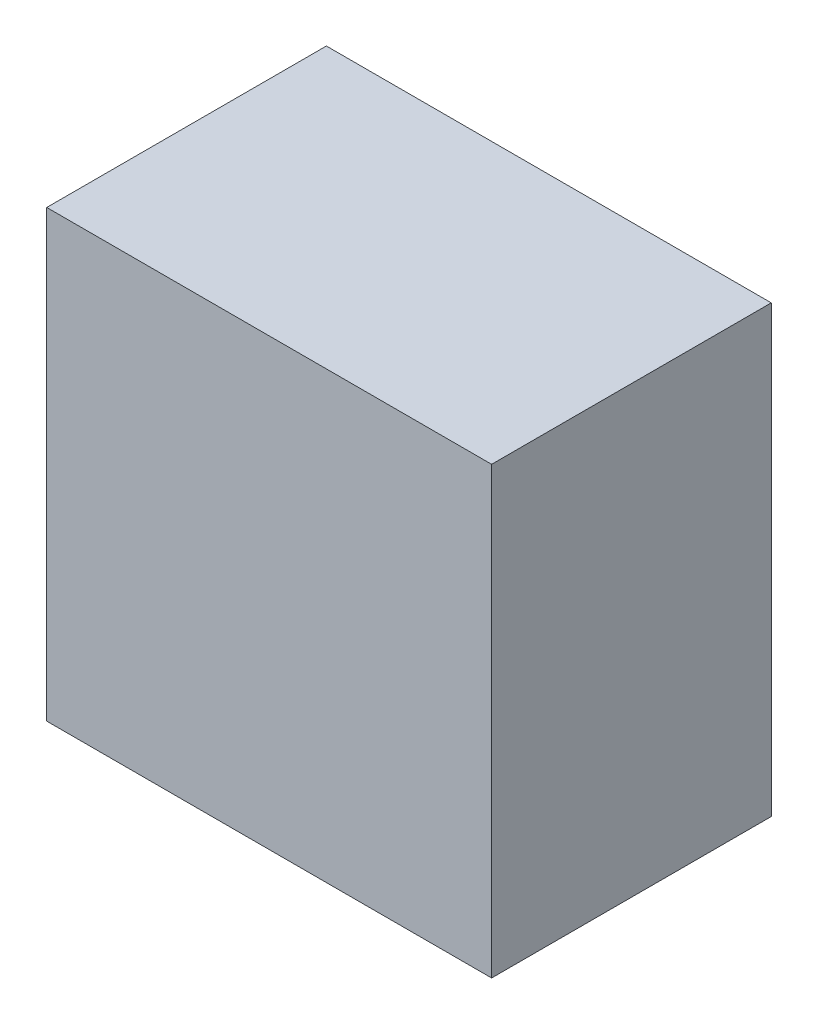
ISO-10303-21;
HEADER;
FILE_DESCRIPTION(('STEP AP214'),'2;1');
FILE_NAME('part.step','',(''),(''),'','','');
FILE_SCHEMA(('AUTOMOTIVE_DESIGN { 1 0 10303 214 1 1 1 1 }'));
ENDSEC;
DATA;
#1=APPLICATION_CONTEXT('core data for automotive mechanical design processes');
#2=APPLICATION_PROTOCOL_DEFINITION('international standard','automotive_design',2000,#1);
#3=PRODUCT_CONTEXT('',#1,'mechanical');
#4=PRODUCT('Part','Part','',(#3));
#5=PRODUCT_RELATED_PRODUCT_CATEGORY('part','',(#4));
#6=PRODUCT_DEFINITION_FORMATION('','',#4);
#7=PRODUCT_DEFINITION_CONTEXT('part definition',#1,'design');
#8=PRODUCT_DEFINITION('design','',#6,#7);
#9=PRODUCT_DEFINITION_SHAPE('','',#8);
#10=(LENGTH_UNIT() NAMED_UNIT(*) SI_UNIT(.MILLI.,.METRE.));
#11=(NAMED_UNIT(*) PLANE_ANGLE_UNIT() SI_UNIT($,.RADIAN.));
#12=(NAMED_UNIT(*) SI_UNIT($,.STERADIAN.) SOLID_ANGLE_UNIT());
#13=UNCERTAINTY_MEASURE_WITH_UNIT(LENGTH_MEASURE(1.E-05),#10,'distance_accuracy_value','');
#14=(GEOMETRIC_REPRESENTATION_CONTEXT(3) GLOBAL_UNCERTAINTY_ASSIGNED_CONTEXT((#13)) GLOBAL_UNIT_ASSIGNED_CONTEXT((#10,
#11,#12)) REPRESENTATION_CONTEXT('',''));
#15=CARTESIAN_POINT('',(0.,0.,0.));
#16=DIRECTION('',(0.,0.,1.));
#17=DIRECTION('',(1.,0.,0.));
#18=AXIS2_PLACEMENT_3D('',#15,#16,#17);
#19=CARTESIAN_POINT('',(-0.35000184,-0.3499993,0.43999912));
#20=DIRECTION('',(0.,0.,1.));
#21=DIRECTION('',(1.,0.,0.));
#22=AXIS2_PLACEMENT_3D('',#19,#20,#21);
#23=PLANE('',#22);
#24=DIRECTION('',(-0.999999999993417,-3.62855234844451E-06,0.));
#25=VECTOR('',#24,1.);
#26=CARTESIAN_POINT('',(-0.35000184,0.3499993,0.43999912));
#27=LINE('',#26,#25);
#28=CARTESIAN_POINT('',(-0.35000184,0.35000057,0.43999912));
#29=VERTEX_POINT('',#28);
#30=CARTESIAN_POINT('',(0.35000184,0.350001839999999,0.43999912));
#31=VERTEX_POINT('',#30);
#32=EDGE_CURVE('E53',#29,#31,#27,.F.);
#33=ORIENTED_EDGE('',*,*,#32,.F.);
#34=DIRECTION('',(0.,1.,0.));
#35=VECTOR('',#34,1.);
#36=CARTESIAN_POINT('',(-0.35000184,-0.3499993,0.43999912));
#37=LINE('',#36,#35);
#38=CARTESIAN_POINT('',(-0.35000184,-0.3499993,0.43999912));
#39=VERTEX_POINT('',#38);
#40=EDGE_CURVE('E68',#39,#29,#37,.T.);
#41=ORIENTED_EDGE('',*,*,#40,.F.);
#42=DIRECTION('',(1.,0.,0.));
#43=VECTOR('',#42,1.);
#44=CARTESIAN_POINT('',(0.35000184,-0.3499993,0.43999912));
#45=LINE('',#44,#43);
#46=CARTESIAN_POINT('',(0.35000184,-0.3499993,0.43999912));
#47=VERTEX_POINT('',#46);
#48=EDGE_CURVE('E20',#47,#39,#45,.F.);
#49=ORIENTED_EDGE('',*,*,#48,.F.);
#50=DIRECTION('',(0.,1.,0.));
#51=VECTOR('',#50,1.);
#52=CARTESIAN_POINT('',(0.35000184,0.35000184,0.43999912));
#53=LINE('',#52,#51);
#54=EDGE_CURVE('E58',#31,#47,#53,.F.);
#55=ORIENTED_EDGE('',*,*,#54,.F.);
#56=EDGE_LOOP('',(#33,#41,#49,#55));
#57=FACE_BOUND('',#56,.T.);
#58=ADVANCED_FACE('F17',(#57),#23,.T.);
#59=CARTESIAN_POINT('',(0.35000184,-0.3499993,0.));
#60=DIRECTION('',(0.,-1.,0.));
#61=DIRECTION('',(0.,0.,-1.));
#62=AXIS2_PLACEMENT_3D('',#59,#60,#61);
#63=PLANE('',#62);
#64=DIRECTION('',(0.,0.,1.));
#65=VECTOR('',#64,1.);
#66=CARTESIAN_POINT('',(-0.35000184,-0.3499993,0.));
#67=LINE('',#66,#65);
#68=CARTESIAN_POINT('',(-0.35000184,-0.3499993,0.));
#69=VERTEX_POINT('',#68);
#70=EDGE_CURVE('E79',#69,#39,#67,.T.);
#71=ORIENTED_EDGE('',*,*,#70,.F.);
#72=DIRECTION('',(1.,0.,0.));
#73=VECTOR('',#72,1.);
#74=CARTESIAN_POINT('',(-0.35000184,-0.3499993,0.));
#75=LINE('',#74,#73);
#76=CARTESIAN_POINT('',(0.35000184,-0.3499993,0.));
#77=VERTEX_POINT('',#76);
#78=EDGE_CURVE('E74',#69,#77,#75,.T.);
#79=ORIENTED_EDGE('',*,*,#78,.T.);
#80=DIRECTION('',(0.,0.,-1.));
#81=VECTOR('',#80,1.);
#82=CARTESIAN_POINT('',(0.35000184,-0.3499993,0.));
#83=LINE('',#82,#81);
#84=EDGE_CURVE('E63',#47,#77,#83,.T.);
#85=ORIENTED_EDGE('',*,*,#84,.F.);
#86=ORIENTED_EDGE('',*,*,#48,.T.);
#87=EDGE_LOOP('',(#71,#79,#85,#86));
#88=FACE_BOUND('',#87,.T.);
#89=ADVANCED_FACE('F73',(#88),#63,.T.);
#90=CARTESIAN_POINT('',(0.35000184,0.35000184,0.));
#91=DIRECTION('',(1.,0.,0.));
#92=DIRECTION('',(0.,0.,-1.));
#93=AXIS2_PLACEMENT_3D('',#90,#91,#92);
#94=PLANE('',#93);
#95=ORIENTED_EDGE('',*,*,#84,.T.);
#96=DIRECTION('',(0.,1.,0.));
#97=VECTOR('',#96,1.);
#98=CARTESIAN_POINT('',(0.35000184,-0.3499993,0.));
#99=LINE('',#98,#97);
#100=CARTESIAN_POINT('',(0.35000184,0.350001839999999,0.));
#101=VERTEX_POINT('',#100);
#102=EDGE_CURVE('E84',#77,#101,#99,.T.);
#103=ORIENTED_EDGE('',*,*,#102,.T.);
#104=DIRECTION('',(0.,0.,1.));
#105=VECTOR('',#104,1.);
#106=CARTESIAN_POINT('',(0.35000184,0.350001839999997,0.));
#107=LINE('',#106,#105);
#108=EDGE_CURVE('E65',#31,#101,#107,.F.);
#109=ORIENTED_EDGE('',*,*,#108,.F.);
#110=ORIENTED_EDGE('',*,*,#54,.T.);
#111=EDGE_LOOP('',(#95,#103,#109,#110));
#112=FACE_BOUND('',#111,.T.);
#113=ADVANCED_FACE('F60',(#112),#94,.T.);
#114=CARTESIAN_POINT('',(-0.35000184,0.3499993,0.));
#115=DIRECTION('',(-3.62855234844451E-06,0.999999999993417,0.));
#116=DIRECTION('',(-0.999999999993417,-3.62855234844451E-06,0.));
#117=AXIS2_PLACEMENT_3D('',#114,#115,#116);
#118=PLANE('',#117);
#119=ORIENTED_EDGE('',*,*,#108,.T.);
#120=DIRECTION('',(1.,0.,0.));
#121=VECTOR('',#120,1.);
#122=CARTESIAN_POINT('',(-0.35000184,0.35000184,0.));
#123=LINE('',#122,#121);
#124=CARTESIAN_POINT('',(-0.35000184,0.349999935,0.));
#125=VERTEX_POINT('',#124);
#126=EDGE_CURVE('E26',#101,#125,#123,.F.);
#127=ORIENTED_EDGE('',*,*,#126,.T.);
#128=DIRECTION('',(0.,0.,1.));
#129=VECTOR('',#128,1.);
#130=CARTESIAN_POINT('',(-0.35000184,0.3499993,0.));
#131=LINE('',#130,#129);
#132=EDGE_CURVE('E34',#29,#125,#131,.F.);
#133=ORIENTED_EDGE('',*,*,#132,.F.);
#134=ORIENTED_EDGE('',*,*,#32,.T.);
#135=EDGE_LOOP('',(#119,#127,#133,#134));
#136=FACE_BOUND('',#135,.T.);
#137=ADVANCED_FACE('F88',(#136),#118,.T.);
#138=CARTESIAN_POINT('',(-0.35000184,-0.3499993,0.));
#139=DIRECTION('',(-1.,0.,0.));
#140=DIRECTION('',(0.,0.,1.));
#141=AXIS2_PLACEMENT_3D('',#138,#139,#140);
#142=PLANE('',#141);
#143=ORIENTED_EDGE('',*,*,#132,.T.);
#144=DIRECTION('',(0.,1.,0.));
#145=VECTOR('',#144,1.);
#146=CARTESIAN_POINT('',(-0.35000184,-0.3499993,0.));
#147=LINE('',#146,#145);
#148=EDGE_CURVE('E11',#125,#69,#147,.F.);
#149=ORIENTED_EDGE('',*,*,#148,.T.);
#150=ORIENTED_EDGE('',*,*,#70,.T.);
#151=ORIENTED_EDGE('',*,*,#40,.T.);
#152=EDGE_LOOP('',(#143,#149,#150,#151));
#153=FACE_BOUND('',#152,.T.);
#154=ADVANCED_FACE('F91',(#153),#142,.T.);
#155=CARTESIAN_POINT('',(-0.35000184,-0.3499993,0.));
#156=DIRECTION('',(0.,0.,1.));
#157=DIRECTION('',(1.,0.,0.));
#158=AXIS2_PLACEMENT_3D('',#155,#156,#157);
#159=PLANE('',#158);
#160=ORIENTED_EDGE('',*,*,#126,.F.);
#161=ORIENTED_EDGE('',*,*,#102,.F.);
#162=ORIENTED_EDGE('',*,*,#78,.F.);
#163=ORIENTED_EDGE('',*,*,#148,.F.);
#164=EDGE_LOOP('',(#160,#161,#162,#163));
#165=FACE_BOUND('',#164,.T.);
#166=ADVANCED_FACE('F90',(#165),#159,.F.);
#167=CLOSED_SHELL('',(#58,#89,#113,#137,#154,#166));
#168=MANIFOLD_SOLID_BREP('B1',#167);
#169=ADVANCED_BREP_SHAPE_REPRESENTATION('',(#18,#168),#14);
#170=SHAPE_DEFINITION_REPRESENTATION(#9,#169);
ENDSEC;
END-ISO-10303-21;
